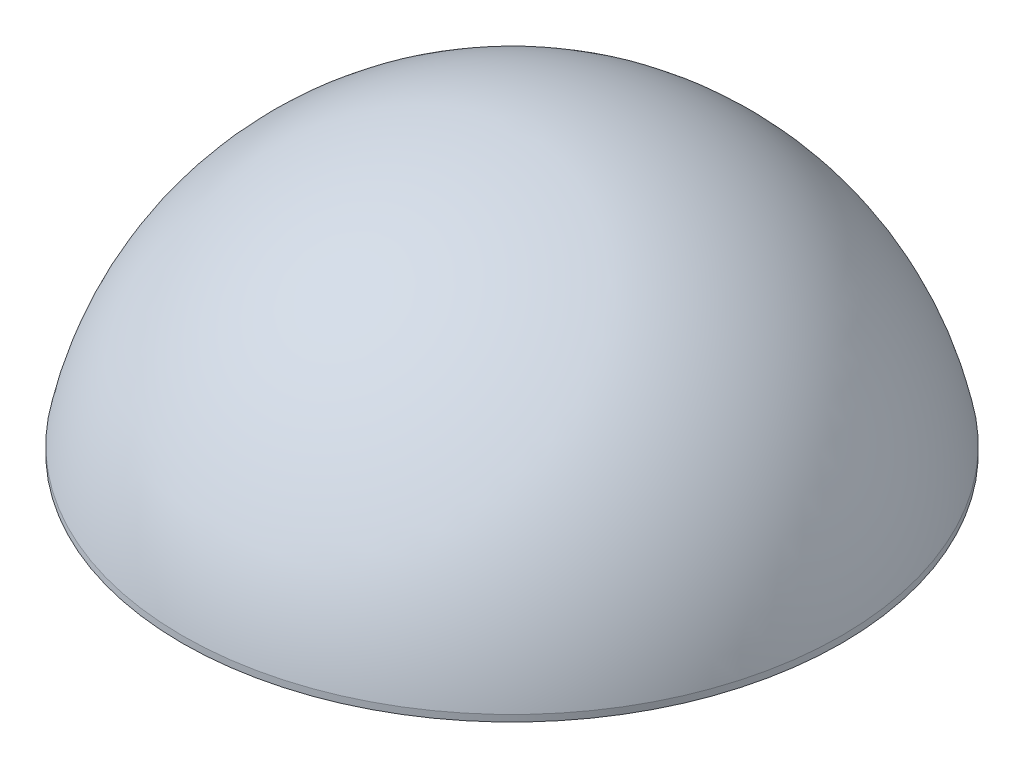
ISO-10303-21;
HEADER;
FILE_DESCRIPTION(('STEP AP214'),'2;1');
FILE_NAME('part.step','',(''),(''),'','','');
FILE_SCHEMA(('AUTOMOTIVE_DESIGN { 1 0 10303 214 1 1 1 1 }'));
ENDSEC;
DATA;
#1=APPLICATION_CONTEXT('core data for automotive mechanical design processes');
#2=APPLICATION_PROTOCOL_DEFINITION('international standard','automotive_design',2000,#1);
#3=PRODUCT_CONTEXT('',#1,'mechanical');
#4=PRODUCT('Part','Part','',(#3));
#5=PRODUCT_RELATED_PRODUCT_CATEGORY('part','',(#4));
#6=PRODUCT_DEFINITION_FORMATION('','',#4);
#7=PRODUCT_DEFINITION_CONTEXT('part definition',#1,'design');
#8=PRODUCT_DEFINITION('design','',#6,#7);
#9=PRODUCT_DEFINITION_SHAPE('','',#8);
#10=(LENGTH_UNIT() NAMED_UNIT(*) SI_UNIT(.MILLI.,.METRE.));
#11=(NAMED_UNIT(*) PLANE_ANGLE_UNIT() SI_UNIT($,.RADIAN.));
#12=(NAMED_UNIT(*) SI_UNIT($,.STERADIAN.) SOLID_ANGLE_UNIT());
#13=UNCERTAINTY_MEASURE_WITH_UNIT(LENGTH_MEASURE(1.E-05),#10,'distance_accuracy_value','');
#14=(GEOMETRIC_REPRESENTATION_CONTEXT(3) GLOBAL_UNCERTAINTY_ASSIGNED_CONTEXT((#13)) GLOBAL_UNIT_ASSIGNED_CONTEXT((#10,
#11,#12)) REPRESENTATION_CONTEXT('',''));
#15=CARTESIAN_POINT('',(0.,0.,0.));
#16=DIRECTION('',(0.,0.,1.));
#17=DIRECTION('',(1.,0.,0.));
#18=AXIS2_PLACEMENT_3D('',#15,#16,#17);
#19=CARTESIAN_POINT('',(0.,2.54,0.));
#20=DIRECTION('',(0.,-1.,0.));
#21=DIRECTION('',(0.,0.,-1.));
#22=AXIS2_PLACEMENT_3D('',#19,#20,#21);
#23=CYLINDRICAL_SURFACE('',#22,127.007592971572);
#24=CARTESIAN_POINT('',(0.,2.54,0.));
#25=DIRECTION('',(0.,1.,0.));
#26=DIRECTION('',(0.,0.,1.));
#27=AXIS2_PLACEMENT_3D('',#24,#25,#26);
#28=CIRCLE('',#27,127.007592971572);
#29=CARTESIAN_POINT('',(0.,2.54,127.007592971572));
#30=VERTEX_POINT('',#29);
#31=EDGE_CURVE('E10',#30,#30,#28,.T.);
#32=ORIENTED_EDGE('',*,*,#31,.F.);
#33=EDGE_LOOP('',(#32));
#34=FACE_BOUND('',#33,.T.);
#35=CARTESIAN_POINT('',(0.,0.,0.));
#36=DIRECTION('',(0.,1.,0.));
#37=DIRECTION('',(0.,0.,1.));
#38=AXIS2_PLACEMENT_3D('',#35,#36,#37);
#39=CIRCLE('',#38,127.007592971572);
#40=CARTESIAN_POINT('',(0.,0.,127.007592971572));
#41=VERTEX_POINT('',#40);
#42=EDGE_CURVE('E35',#41,#41,#39,.T.);
#43=ORIENTED_EDGE('',*,*,#42,.T.);
#44=EDGE_LOOP('',(#43));
#45=FACE_BOUND('',#44,.T.);
#46=ADVANCED_FACE('F28',(#34,#45),#23,.T.);
#47=CARTESIAN_POINT('',(0.,-22.8382843884795,0.));
#48=DIRECTION('',(0.,0.,1.));
#49=DIRECTION('',(1.,0.,0.));
#50=AXIS2_PLACEMENT_3D('',#47,#48,#49);
#51=SPHERICAL_SURFACE('',#50,129.518284388479);
#52=CARTESIAN_POINT('',(0.,-22.8382843884795,0.));
#53=DIRECTION('',(0.,1.,0.));
#54=DIRECTION('',(0.,0.,1.));
#55=AXIS2_PLACEMENT_3D('',#52,#53,#54);
#56=SPHERICAL_SURFACE('',#55,129.518284388479);
#57=ORIENTED_EDGE('',*,*,#31,.T.);
#58=EDGE_LOOP('',(#57));
#59=FACE_BOUND('',#58,.T.);
#60=ADVANCED_FACE('F30',(#59),#56,.T.);
#61=CARTESIAN_POINT('',(0.,0.,0.));
#62=DIRECTION('',(0.,1.,0.));
#63=DIRECTION('',(0.,0.,1.));
#64=AXIS2_PLACEMENT_3D('',#61,#62,#63);
#65=PLANE('',#64);
#66=ORIENTED_EDGE('',*,*,#42,.F.);
#67=EDGE_LOOP('',(#66));
#68=FACE_BOUND('',#67,.T.);
#69=ADVANCED_FACE('F42',(#68),#65,.F.);
#70=CLOSED_SHELL('',(#46,#60,#69));
#71=MANIFOLD_SOLID_BREP('B2',#70);
#72=ADVANCED_BREP_SHAPE_REPRESENTATION('',(#18,#71),#14);
#73=SHAPE_DEFINITION_REPRESENTATION(#9,#72);
ENDSEC;
END-ISO-10303-21;
